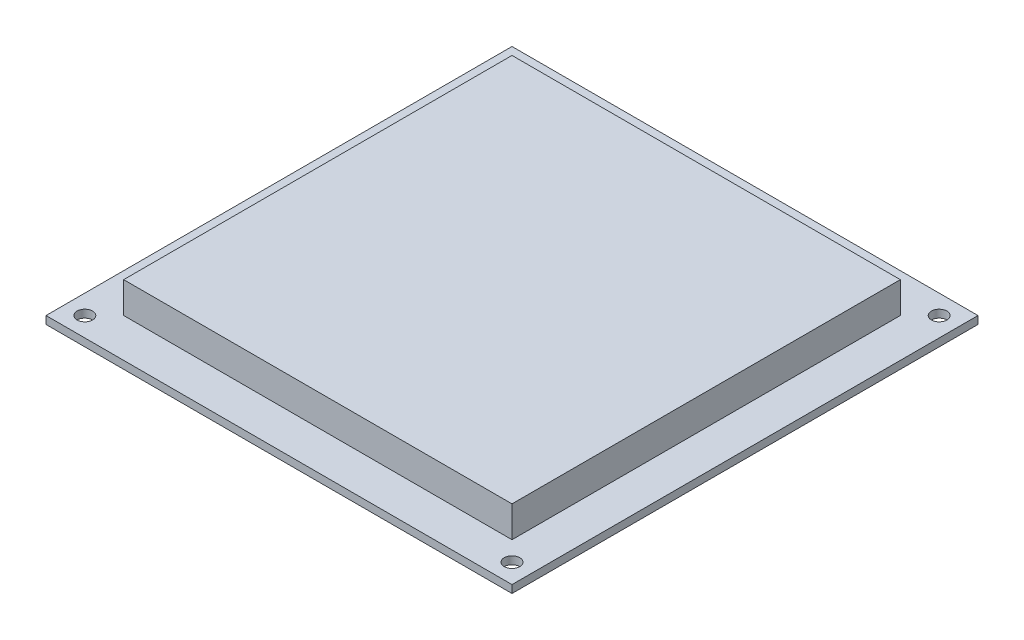
ISO-10303-21;
HEADER;
FILE_DESCRIPTION(('STEP AP214'),'2;1');
FILE_NAME('part.step','',(''),(''),'','','');
FILE_SCHEMA(('AUTOMOTIVE_DESIGN { 1 0 10303 214 1 1 1 1 }'));
ENDSEC;
DATA;
#1=APPLICATION_CONTEXT('core data for automotive mechanical design processes');
#2=APPLICATION_PROTOCOL_DEFINITION('international standard','automotive_design',2000,#1);
#3=PRODUCT_CONTEXT('',#1,'mechanical');
#4=PRODUCT('Part','Part','',(#3));
#5=PRODUCT_RELATED_PRODUCT_CATEGORY('part','',(#4));
#6=PRODUCT_DEFINITION_FORMATION('','',#4);
#7=PRODUCT_DEFINITION_CONTEXT('part definition',#1,'design');
#8=PRODUCT_DEFINITION('design','',#6,#7);
#9=PRODUCT_DEFINITION_SHAPE('','',#8);
#10=(LENGTH_UNIT() NAMED_UNIT(*) SI_UNIT(.MILLI.,.METRE.));
#11=(NAMED_UNIT(*) PLANE_ANGLE_UNIT() SI_UNIT($,.RADIAN.));
#12=(NAMED_UNIT(*) SI_UNIT($,.STERADIAN.) SOLID_ANGLE_UNIT());
#13=UNCERTAINTY_MEASURE_WITH_UNIT(LENGTH_MEASURE(1.E-05),#10,'distance_accuracy_value','');
#14=(GEOMETRIC_REPRESENTATION_CONTEXT(3) GLOBAL_UNCERTAINTY_ASSIGNED_CONTEXT((#13)) GLOBAL_UNIT_ASSIGNED_CONTEXT((#10,
#11,#12)) REPRESENTATION_CONTEXT('',''));
#15=CARTESIAN_POINT('',(0.,0.,0.));
#16=DIRECTION('',(0.,0.,1.));
#17=DIRECTION('',(1.,0.,0.));
#18=AXIS2_PLACEMENT_3D('',#15,#16,#17);
#19=CARTESIAN_POINT('',(0.,0.,0.));
#20=DIRECTION('',(0.,1.,0.));
#21=DIRECTION('',(0.,0.,1.));
#22=AXIS2_PLACEMENT_3D('',#19,#20,#21);
#23=PLANE('',#22);
#24=CARTESIAN_POINT('',(-69.85,0.,-69.85));
#25=DIRECTION('',(0.,1.,0.));
#26=DIRECTION('',(0.,0.,1.));
#27=AXIS2_PLACEMENT_3D('',#24,#25,#26);
#28=CIRCLE('',#27,2.53999999999999);
#29=CARTESIAN_POINT('',(-69.85,0.,-67.31));
#30=VERTEX_POINT('',#29);
#31=EDGE_CURVE('E131',#30,#30,#28,.T.);
#32=ORIENTED_EDGE('',*,*,#31,.F.);
#33=EDGE_LOOP('',(#32));
#34=FACE_BOUND('',#33,.T.);
#35=CARTESIAN_POINT('',(69.85,0.,-69.85));
#36=DIRECTION('',(0.,1.,0.));
#37=DIRECTION('',(0.,0.,1.));
#38=AXIS2_PLACEMENT_3D('',#35,#36,#37);
#39=CIRCLE('',#38,2.53999999999999);
#40=CARTESIAN_POINT('',(69.85,0.,-67.31));
#41=VERTEX_POINT('',#40);
#42=EDGE_CURVE('E149',#41,#41,#39,.T.);
#43=ORIENTED_EDGE('',*,*,#42,.F.);
#44=EDGE_LOOP('',(#43));
#45=FACE_BOUND('',#44,.T.);
#46=CARTESIAN_POINT('',(69.85,0.,69.85));
#47=DIRECTION('',(0.,1.,0.));
#48=DIRECTION('',(0.,0.,1.));
#49=AXIS2_PLACEMENT_3D('',#46,#47,#48);
#50=CIRCLE('',#49,2.53999999999999);
#51=CARTESIAN_POINT('',(69.85,0.,72.39));
#52=VERTEX_POINT('',#51);
#53=EDGE_CURVE('E143',#52,#52,#50,.T.);
#54=ORIENTED_EDGE('',*,*,#53,.F.);
#55=EDGE_LOOP('',(#54));
#56=FACE_BOUND('',#55,.T.);
#57=CARTESIAN_POINT('',(-69.85,0.,69.85));
#58=DIRECTION('',(0.,1.,0.));
#59=DIRECTION('',(0.,0.,1.));
#60=AXIS2_PLACEMENT_3D('',#57,#58,#59);
#61=CIRCLE('',#60,2.53999999999999);
#62=CARTESIAN_POINT('',(-69.85,0.,72.39));
#63=VERTEX_POINT('',#62);
#64=EDGE_CURVE('E142',#63,#63,#61,.T.);
#65=ORIENTED_EDGE('',*,*,#64,.F.);
#66=EDGE_LOOP('',(#65));
#67=FACE_BOUND('',#66,.T.);
#68=DIRECTION('',(0.,0.,-1.));
#69=VECTOR('',#68,1.);
#70=CARTESIAN_POINT('',(76.2,0.,-76.2));
#71=LINE('',#70,#69);
#72=CARTESIAN_POINT('',(76.2,0.,76.2));
#73=VERTEX_POINT('',#72);
#74=CARTESIAN_POINT('',(76.2,0.,-76.2));
#75=VERTEX_POINT('',#74);
#76=EDGE_CURVE('E157',#73,#75,#71,.T.);
#77=ORIENTED_EDGE('',*,*,#76,.T.);
#78=DIRECTION('',(-1.,0.,0.));
#79=VECTOR('',#78,1.);
#80=CARTESIAN_POINT('',(-76.2,0.,-76.2));
#81=LINE('',#80,#79);
#82=CARTESIAN_POINT('',(-76.2,0.,-76.2));
#83=VERTEX_POINT('',#82);
#84=EDGE_CURVE('E172',#75,#83,#81,.T.);
#85=ORIENTED_EDGE('',*,*,#84,.T.);
#86=DIRECTION('',(0.,0.,1.));
#87=VECTOR('',#86,1.);
#88=CARTESIAN_POINT('',(-76.2,0.,-76.2));
#89=LINE('',#88,#87);
#90=CARTESIAN_POINT('',(-76.2,0.,76.2));
#91=VERTEX_POINT('',#90);
#92=EDGE_CURVE('E175',#83,#91,#89,.T.);
#93=ORIENTED_EDGE('',*,*,#92,.T.);
#94=DIRECTION('',(1.,0.,0.));
#95=VECTOR('',#94,1.);
#96=CARTESIAN_POINT('',(-76.2,0.,76.2));
#97=LINE('',#96,#95);
#98=EDGE_CURVE('E163',#91,#73,#97,.T.);
#99=ORIENTED_EDGE('',*,*,#98,.T.);
#100=EDGE_LOOP('',(#77,#85,#93,#99));
#101=FACE_BOUND('',#100,.T.);
#102=DIRECTION('',(-1.,0.,0.));
#103=VECTOR('',#102,1.);
#104=CARTESIAN_POINT('',(-63.5,0.,-63.5));
#105=LINE('',#104,#103);
#106=CARTESIAN_POINT('',(63.5,0.,-63.5));
#107=VERTEX_POINT('',#106);
#108=CARTESIAN_POINT('',(-63.5,0.,-63.5));
#109=VERTEX_POINT('',#108);
#110=EDGE_CURVE('E320',#107,#109,#105,.T.);
#111=ORIENTED_EDGE('',*,*,#110,.F.);
#112=DIRECTION('',(0.,0.,-1.));
#113=VECTOR('',#112,1.);
#114=CARTESIAN_POINT('',(63.5,0.,-63.5));
#115=LINE('',#114,#113);
#116=CARTESIAN_POINT('',(63.5,0.,63.5));
#117=VERTEX_POINT('',#116);
#118=EDGE_CURVE('E129',#117,#107,#115,.T.);
#119=ORIENTED_EDGE('',*,*,#118,.F.);
#120=DIRECTION('',(1.,0.,0.));
#121=VECTOR('',#120,1.);
#122=CARTESIAN_POINT('',(-63.5,0.,63.5));
#123=LINE('',#122,#121);
#124=CARTESIAN_POINT('',(-63.5,0.,63.5));
#125=VERTEX_POINT('',#124);
#126=EDGE_CURVE('E125',#125,#117,#123,.T.);
#127=ORIENTED_EDGE('',*,*,#126,.F.);
#128=DIRECTION('',(0.,0.,1.));
#129=VECTOR('',#128,1.);
#130=CARTESIAN_POINT('',(-63.5,0.,-63.5));
#131=LINE('',#130,#129);
#132=EDGE_CURVE('E317',#109,#125,#131,.T.);
#133=ORIENTED_EDGE('',*,*,#132,.F.);
#134=EDGE_LOOP('',(#111,#119,#127,#133));
#135=FACE_BOUND('',#134,.T.);
#136=ADVANCED_FACE('F33',(#34,#45,#56,#67,#101,#135),#23,.T.);
#137=CARTESIAN_POINT('',(76.2,-2.54,-76.2));
#138=DIRECTION('',(1.,0.,0.));
#139=DIRECTION('',(0.,0.,-1.));
#140=AXIS2_PLACEMENT_3D('',#137,#138,#139);
#141=PLANE('',#140);
#142=ORIENTED_EDGE('',*,*,#76,.F.);
#143=DIRECTION('',(0.,1.,0.));
#144=VECTOR('',#143,1.);
#145=CARTESIAN_POINT('',(76.2,-2.54,76.2));
#146=LINE('',#145,#144);
#147=CARTESIAN_POINT('',(76.2,-2.54,76.2));
#148=VERTEX_POINT('',#147);
#149=EDGE_CURVE('E11',#148,#73,#146,.T.);
#150=ORIENTED_EDGE('',*,*,#149,.F.);
#151=DIRECTION('',(0.,0.,-1.));
#152=VECTOR('',#151,1.);
#153=CARTESIAN_POINT('',(76.2,-2.54,-76.2));
#154=LINE('',#153,#152);
#155=CARTESIAN_POINT('',(76.2,-2.54,-76.2));
#156=VERTEX_POINT('',#155);
#157=EDGE_CURVE('E160',#148,#156,#154,.T.);
#158=ORIENTED_EDGE('',*,*,#157,.T.);
#159=DIRECTION('',(0.,1.,0.));
#160=VECTOR('',#159,1.);
#161=CARTESIAN_POINT('',(76.2,-2.54,-76.2));
#162=LINE('',#161,#160);
#163=EDGE_CURVE('E37',#156,#75,#162,.T.);
#164=ORIENTED_EDGE('',*,*,#163,.T.);
#165=EDGE_LOOP('',(#142,#150,#158,#164));
#166=FACE_BOUND('',#165,.T.);
#167=ADVANCED_FACE('F35',(#166),#141,.T.);
#168=CARTESIAN_POINT('',(-76.2,-2.54,76.2));
#169=DIRECTION('',(0.,0.,1.));
#170=DIRECTION('',(1.,0.,0.));
#171=AXIS2_PLACEMENT_3D('',#168,#169,#170);
#172=PLANE('',#171);
#173=ORIENTED_EDGE('',*,*,#98,.F.);
#174=DIRECTION('',(0.,1.,0.));
#175=VECTOR('',#174,1.);
#176=CARTESIAN_POINT('',(-76.2,-2.54,76.2));
#177=LINE('',#176,#175);
#178=CARTESIAN_POINT('',(-76.2,-2.54,76.2));
#179=VERTEX_POINT('',#178);
#180=EDGE_CURVE('E42',#179,#91,#177,.T.);
#181=ORIENTED_EDGE('',*,*,#180,.F.);
#182=DIRECTION('',(1.,0.,0.));
#183=VECTOR('',#182,1.);
#184=CARTESIAN_POINT('',(-76.2,-2.54,76.2));
#185=LINE('',#184,#183);
#186=EDGE_CURVE('E168',#179,#148,#185,.T.);
#187=ORIENTED_EDGE('',*,*,#186,.T.);
#188=ORIENTED_EDGE('',*,*,#149,.T.);
#189=EDGE_LOOP('',(#173,#181,#187,#188));
#190=FACE_BOUND('',#189,.T.);
#191=ADVANCED_FACE('F185',(#190),#172,.T.);
#192=CARTESIAN_POINT('',(-76.2,-2.54,-76.2));
#193=DIRECTION('',(-1.,0.,0.));
#194=DIRECTION('',(0.,0.,1.));
#195=AXIS2_PLACEMENT_3D('',#192,#193,#194);
#196=PLANE('',#195);
#197=ORIENTED_EDGE('',*,*,#92,.F.);
#198=DIRECTION('',(0.,1.,0.));
#199=VECTOR('',#198,1.);
#200=CARTESIAN_POINT('',(-76.2,-2.54,-76.2));
#201=LINE('',#200,#199);
#202=CARTESIAN_POINT('',(-76.2,-2.54,-76.2));
#203=VERTEX_POINT('',#202);
#204=EDGE_CURVE('E180',#203,#83,#201,.T.);
#205=ORIENTED_EDGE('',*,*,#204,.F.);
#206=DIRECTION('',(0.,0.,1.));
#207=VECTOR('',#206,1.);
#208=CARTESIAN_POINT('',(-76.2,-2.54,-76.2));
#209=LINE('',#208,#207);
#210=EDGE_CURVE('E165',#203,#179,#209,.T.);
#211=ORIENTED_EDGE('',*,*,#210,.T.);
#212=ORIENTED_EDGE('',*,*,#180,.T.);
#213=EDGE_LOOP('',(#197,#205,#211,#212));
#214=FACE_BOUND('',#213,.T.);
#215=ADVANCED_FACE('F189',(#214),#196,.T.);
#216=CARTESIAN_POINT('',(-76.2,-2.54,-76.2));
#217=DIRECTION('',(0.,0.,-1.));
#218=DIRECTION('',(-1.,0.,0.));
#219=AXIS2_PLACEMENT_3D('',#216,#217,#218);
#220=PLANE('',#219);
#221=ORIENTED_EDGE('',*,*,#84,.F.);
#222=ORIENTED_EDGE('',*,*,#163,.F.);
#223=DIRECTION('',(-1.,0.,0.));
#224=VECTOR('',#223,1.);
#225=CARTESIAN_POINT('',(-76.2,-2.54,-76.2));
#226=LINE('',#225,#224);
#227=EDGE_CURVE('E162',#156,#203,#226,.T.);
#228=ORIENTED_EDGE('',*,*,#227,.T.);
#229=ORIENTED_EDGE('',*,*,#204,.T.);
#230=EDGE_LOOP('',(#221,#222,#228,#229));
#231=FACE_BOUND('',#230,.T.);
#232=ADVANCED_FACE('F182',(#231),#220,.T.);
#233=CARTESIAN_POINT('',(0.,-2.54,0.));
#234=DIRECTION('',(0.,1.,0.));
#235=DIRECTION('',(0.,0.,1.));
#236=AXIS2_PLACEMENT_3D('',#233,#234,#235);
#237=PLANE('',#236);
#238=CARTESIAN_POINT('',(-69.85,-2.54,-69.85));
#239=DIRECTION('',(0.,1.,0.));
#240=DIRECTION('',(0.,0.,1.));
#241=AXIS2_PLACEMENT_3D('',#238,#239,#240);
#242=CIRCLE('',#241,2.53999999999999);
#243=CARTESIAN_POINT('',(-69.85,-2.54,-67.31));
#244=VERTEX_POINT('',#243);
#245=EDGE_CURVE('E134',#244,#244,#242,.T.);
#246=ORIENTED_EDGE('',*,*,#245,.T.);
#247=EDGE_LOOP('',(#246));
#248=FACE_BOUND('',#247,.T.);
#249=CARTESIAN_POINT('',(69.85,-2.54,-69.85));
#250=DIRECTION('',(0.,1.,0.));
#251=DIRECTION('',(0.,0.,1.));
#252=AXIS2_PLACEMENT_3D('',#249,#250,#251);
#253=CIRCLE('',#252,2.53999999999999);
#254=CARTESIAN_POINT('',(69.85,-2.54,-67.31));
#255=VERTEX_POINT('',#254);
#256=EDGE_CURVE('E146',#255,#255,#253,.T.);
#257=ORIENTED_EDGE('',*,*,#256,.T.);
#258=EDGE_LOOP('',(#257));
#259=FACE_BOUND('',#258,.T.);
#260=CARTESIAN_POINT('',(69.85,-2.54,69.85));
#261=DIRECTION('',(0.,1.,0.));
#262=DIRECTION('',(0.,0.,1.));
#263=AXIS2_PLACEMENT_3D('',#260,#261,#262);
#264=CIRCLE('',#263,2.53999999999999);
#265=CARTESIAN_POINT('',(69.85,-2.54,72.39));
#266=VERTEX_POINT('',#265);
#267=EDGE_CURVE('E139',#266,#266,#264,.T.);
#268=ORIENTED_EDGE('',*,*,#267,.T.);
#269=EDGE_LOOP('',(#268));
#270=FACE_BOUND('',#269,.T.);
#271=CARTESIAN_POINT('',(-69.85,-2.54,69.85));
#272=DIRECTION('',(0.,1.,0.));
#273=DIRECTION('',(0.,0.,1.));
#274=AXIS2_PLACEMENT_3D('',#271,#272,#273);
#275=CIRCLE('',#274,2.53999999999999);
#276=CARTESIAN_POINT('',(-69.85,-2.54,72.39));
#277=VERTEX_POINT('',#276);
#278=EDGE_CURVE('E154',#277,#277,#275,.T.);
#279=ORIENTED_EDGE('',*,*,#278,.T.);
#280=EDGE_LOOP('',(#279));
#281=FACE_BOUND('',#280,.T.);
#282=ORIENTED_EDGE('',*,*,#157,.F.);
#283=ORIENTED_EDGE('',*,*,#186,.F.);
#284=ORIENTED_EDGE('',*,*,#210,.F.);
#285=ORIENTED_EDGE('',*,*,#227,.F.);
#286=EDGE_LOOP('',(#282,#283,#284,#285));
#287=FACE_BOUND('',#286,.T.);
#288=ADVANCED_FACE('F191',(#248,#259,#270,#281,#287),#237,.F.);
#289=CARTESIAN_POINT('',(-69.85,-2.54,69.85));
#290=DIRECTION('',(0.,1.,0.));
#291=DIRECTION('',(0.,0.,1.));
#292=AXIS2_PLACEMENT_3D('',#289,#290,#291);
#293=CYLINDRICAL_SURFACE('',#292,2.53999999999999);
#294=ORIENTED_EDGE('',*,*,#278,.F.);
#295=EDGE_LOOP('',(#294));
#296=FACE_BOUND('',#295,.T.);
#297=ORIENTED_EDGE('',*,*,#64,.T.);
#298=EDGE_LOOP('',(#297));
#299=FACE_BOUND('',#298,.T.);
#300=ADVANCED_FACE('F193',(#296,#299),#293,.F.);
#301=CARTESIAN_POINT('',(69.85,-2.54,69.85));
#302=DIRECTION('',(0.,1.,0.));
#303=DIRECTION('',(0.,0.,1.));
#304=AXIS2_PLACEMENT_3D('',#301,#302,#303);
#305=CYLINDRICAL_SURFACE('',#304,2.53999999999999);
#306=ORIENTED_EDGE('',*,*,#267,.F.);
#307=EDGE_LOOP('',(#306));
#308=FACE_BOUND('',#307,.T.);
#309=ORIENTED_EDGE('',*,*,#53,.T.);
#310=EDGE_LOOP('',(#309));
#311=FACE_BOUND('',#310,.T.);
#312=ADVANCED_FACE('F200',(#308,#311),#305,.F.);
#313=CARTESIAN_POINT('',(69.85,-2.54,-69.85));
#314=DIRECTION('',(0.,1.,0.));
#315=DIRECTION('',(0.,0.,1.));
#316=AXIS2_PLACEMENT_3D('',#313,#314,#315);
#317=CYLINDRICAL_SURFACE('',#316,2.53999999999999);
#318=ORIENTED_EDGE('',*,*,#256,.F.);
#319=EDGE_LOOP('',(#318));
#320=FACE_BOUND('',#319,.T.);
#321=ORIENTED_EDGE('',*,*,#42,.T.);
#322=EDGE_LOOP('',(#321));
#323=FACE_BOUND('',#322,.T.);
#324=ADVANCED_FACE('F243',(#320,#323),#317,.F.);
#325=CARTESIAN_POINT('',(-69.85,-2.54,-69.85));
#326=DIRECTION('',(0.,1.,0.));
#327=DIRECTION('',(0.,0.,1.));
#328=AXIS2_PLACEMENT_3D('',#325,#326,#327);
#329=CYLINDRICAL_SURFACE('',#328,2.53999999999999);
#330=ORIENTED_EDGE('',*,*,#245,.F.);
#331=EDGE_LOOP('',(#330));
#332=FACE_BOUND('',#331,.T.);
#333=ORIENTED_EDGE('',*,*,#31,.T.);
#334=EDGE_LOOP('',(#333));
#335=FACE_BOUND('',#334,.T.);
#336=ADVANCED_FACE('F253',(#332,#335),#329,.F.);
#337=CARTESIAN_POINT('',(63.5,10.16,-63.5));
#338=DIRECTION('',(-1.,0.,0.));
#339=DIRECTION('',(0.,0.,1.));
#340=AXIS2_PLACEMENT_3D('',#337,#338,#339);
#341=PLANE('',#340);
#342=ORIENTED_EDGE('',*,*,#118,.T.);
#343=DIRECTION('',(0.,-1.,0.));
#344=VECTOR('',#343,1.);
#345=CARTESIAN_POINT('',(63.5,10.16,-63.5));
#346=LINE('',#345,#344);
#347=CARTESIAN_POINT('',(63.5,10.16,-63.5));
#348=VERTEX_POINT('',#347);
#349=EDGE_CURVE('E110',#348,#107,#346,.T.);
#350=ORIENTED_EDGE('',*,*,#349,.F.);
#351=DIRECTION('',(0.,0.,-1.));
#352=VECTOR('',#351,1.);
#353=CARTESIAN_POINT('',(63.5,10.16,-63.5));
#354=LINE('',#353,#352);
#355=CARTESIAN_POINT('',(63.5,10.16,63.5));
#356=VERTEX_POINT('',#355);
#357=EDGE_CURVE('E117',#356,#348,#354,.T.);
#358=ORIENTED_EDGE('',*,*,#357,.F.);
#359=DIRECTION('',(0.,-1.,0.));
#360=VECTOR('',#359,1.);
#361=CARTESIAN_POINT('',(63.5,10.16,63.5));
#362=LINE('',#361,#360);
#363=EDGE_CURVE('E315',#356,#117,#362,.T.);
#364=ORIENTED_EDGE('',*,*,#363,.T.);
#365=EDGE_LOOP('',(#342,#350,#358,#364));
#366=FACE_BOUND('',#365,.T.);
#367=ADVANCED_FACE('F127',(#366),#341,.F.);
#368=CARTESIAN_POINT('',(-63.5,10.16,-63.5));
#369=DIRECTION('',(0.,0.,1.));
#370=DIRECTION('',(1.,0.,0.));
#371=AXIS2_PLACEMENT_3D('',#368,#369,#370);
#372=PLANE('',#371);
#373=ORIENTED_EDGE('',*,*,#110,.T.);
#374=DIRECTION('',(0.,-1.,0.));
#375=VECTOR('',#374,1.);
#376=CARTESIAN_POINT('',(-63.5,10.16,-63.5));
#377=LINE('',#376,#375);
#378=CARTESIAN_POINT('',(-63.5,10.16,-63.5));
#379=VERTEX_POINT('',#378);
#380=EDGE_CURVE('E113',#379,#109,#377,.T.);
#381=ORIENTED_EDGE('',*,*,#380,.F.);
#382=DIRECTION('',(-1.,0.,0.));
#383=VECTOR('',#382,1.);
#384=CARTESIAN_POINT('',(-63.5,10.16,-63.5));
#385=LINE('',#384,#383);
#386=EDGE_CURVE('E106',#348,#379,#385,.T.);
#387=ORIENTED_EDGE('',*,*,#386,.F.);
#388=ORIENTED_EDGE('',*,*,#349,.T.);
#389=EDGE_LOOP('',(#373,#381,#387,#388));
#390=FACE_BOUND('',#389,.T.);
#391=ADVANCED_FACE('F108',(#390),#372,.F.);
#392=CARTESIAN_POINT('',(-63.5,10.16,-63.5));
#393=DIRECTION('',(1.,0.,0.));
#394=DIRECTION('',(0.,0.,-1.));
#395=AXIS2_PLACEMENT_3D('',#392,#393,#394);
#396=PLANE('',#395);
#397=ORIENTED_EDGE('',*,*,#132,.T.);
#398=DIRECTION('',(0.,-1.,0.));
#399=VECTOR('',#398,1.);
#400=CARTESIAN_POINT('',(-63.5,10.16,63.5));
#401=LINE('',#400,#399);
#402=CARTESIAN_POINT('',(-63.5,10.16,63.5));
#403=VERTEX_POINT('',#402);
#404=EDGE_CURVE('E50',#403,#125,#401,.T.);
#405=ORIENTED_EDGE('',*,*,#404,.F.);
#406=DIRECTION('',(0.,0.,1.));
#407=VECTOR('',#406,1.);
#408=CARTESIAN_POINT('',(-63.5,10.16,-63.5));
#409=LINE('',#408,#407);
#410=EDGE_CURVE('E116',#379,#403,#409,.T.);
#411=ORIENTED_EDGE('',*,*,#410,.F.);
#412=ORIENTED_EDGE('',*,*,#380,.T.);
#413=EDGE_LOOP('',(#397,#405,#411,#412));
#414=FACE_BOUND('',#413,.T.);
#415=ADVANCED_FACE('F284',(#414),#396,.F.);
#416=CARTESIAN_POINT('',(-63.5,10.16,63.5));
#417=DIRECTION('',(0.,0.,-1.));
#418=DIRECTION('',(-1.,0.,0.));
#419=AXIS2_PLACEMENT_3D('',#416,#417,#418);
#420=PLANE('',#419);
#421=ORIENTED_EDGE('',*,*,#126,.T.);
#422=ORIENTED_EDGE('',*,*,#363,.F.);
#423=DIRECTION('',(1.,0.,0.));
#424=VECTOR('',#423,1.);
#425=CARTESIAN_POINT('',(-63.5,10.16,63.5));
#426=LINE('',#425,#424);
#427=EDGE_CURVE('E121',#403,#356,#426,.T.);
#428=ORIENTED_EDGE('',*,*,#427,.F.);
#429=ORIENTED_EDGE('',*,*,#404,.T.);
#430=EDGE_LOOP('',(#421,#422,#428,#429));
#431=FACE_BOUND('',#430,.T.);
#432=ADVANCED_FACE('F293',(#431),#420,.F.);
#433=CARTESIAN_POINT('',(0.,10.16,0.));
#434=DIRECTION('',(0.,1.,0.));
#435=DIRECTION('',(0.,0.,1.));
#436=AXIS2_PLACEMENT_3D('',#433,#434,#435);
#437=PLANE('',#436);
#438=ORIENTED_EDGE('',*,*,#357,.T.);
#439=ORIENTED_EDGE('',*,*,#386,.T.);
#440=ORIENTED_EDGE('',*,*,#410,.T.);
#441=ORIENTED_EDGE('',*,*,#427,.T.);
#442=EDGE_LOOP('',(#438,#439,#440,#441));
#443=FACE_BOUND('',#442,.T.);
#444=ADVANCED_FACE('F120',(#443),#437,.T.);
#445=CLOSED_SHELL('',(#136,#167,#191,#215,#232,#288,#300,#312,#324,#336,#367,#391,#415,#432,#444));
#446=MANIFOLD_SOLID_BREP('B2',#445);
#447=ADVANCED_BREP_SHAPE_REPRESENTATION('',(#18,#446),#14);
#448=SHAPE_DEFINITION_REPRESENTATION(#9,#447);
ENDSEC;
END-ISO-10303-21;
